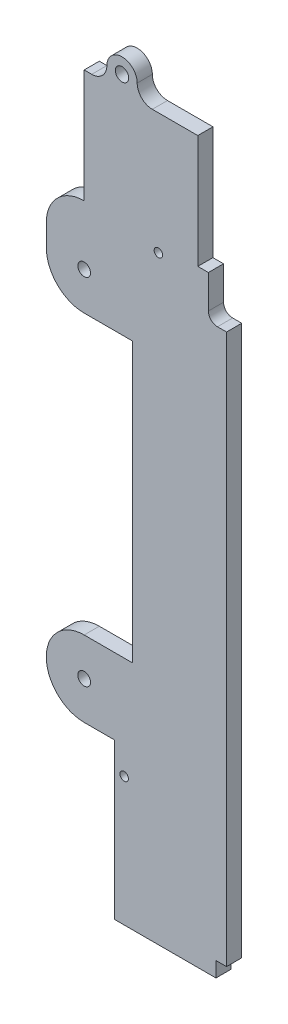
ISO-10303-21;
HEADER;
FILE_DESCRIPTION(('STEP AP214'),'2;1');
FILE_NAME('part.step','',(''),(''),'','','');
FILE_SCHEMA(('AUTOMOTIVE_DESIGN { 1 0 10303 214 1 1 1 1 }'));
ENDSEC;
DATA;
#1=APPLICATION_CONTEXT('core data for automotive mechanical design processes');
#2=APPLICATION_PROTOCOL_DEFINITION('international standard','automotive_design',2000,#1);
#3=PRODUCT_CONTEXT('',#1,'mechanical');
#4=PRODUCT('Part','Part','',(#3));
#5=PRODUCT_RELATED_PRODUCT_CATEGORY('part','',(#4));
#6=PRODUCT_DEFINITION_FORMATION('','',#4);
#7=PRODUCT_DEFINITION_CONTEXT('part definition',#1,'design');
#8=PRODUCT_DEFINITION('design','',#6,#7);
#9=PRODUCT_DEFINITION_SHAPE('','',#8);
#10=(LENGTH_UNIT() NAMED_UNIT(*) SI_UNIT(.MILLI.,.METRE.));
#11=(NAMED_UNIT(*) PLANE_ANGLE_UNIT() SI_UNIT($,.RADIAN.));
#12=(NAMED_UNIT(*) SI_UNIT($,.STERADIAN.) SOLID_ANGLE_UNIT());
#13=UNCERTAINTY_MEASURE_WITH_UNIT(LENGTH_MEASURE(1.E-05),#10,'distance_accuracy_value','');
#14=(GEOMETRIC_REPRESENTATION_CONTEXT(3) GLOBAL_UNCERTAINTY_ASSIGNED_CONTEXT((#13)) GLOBAL_UNIT_ASSIGNED_CONTEXT((#10,
#11,#12)) REPRESENTATION_CONTEXT('',''));
#15=CARTESIAN_POINT('',(0.,0.,0.));
#16=DIRECTION('',(0.,0.,1.));
#17=DIRECTION('',(1.,0.,0.));
#18=AXIS2_PLACEMENT_3D('',#15,#16,#17);
#19=CARTESIAN_POINT('',(44.,125.6,5.));
#20=DIRECTION('',(0.,0.,1.));
#21=DIRECTION('',(1.,0.,0.));
#22=AXIS2_PLACEMENT_3D('',#19,#20,#21);
#23=PLANE('',#22);
#24=CARTESIAN_POINT('',(24.5,134.,5.));
#25=DIRECTION('',(0.,0.,1.));
#26=DIRECTION('',(1.,0.,0.));
#27=AXIS2_PLACEMENT_3D('',#24,#25,#26);
#28=CIRCLE('',#27,1.40000000000001);
#29=CARTESIAN_POINT('',(25.9,134.,5.));
#30=VERTEX_POINT('',#29);
#31=EDGE_CURVE('E455',#30,#30,#28,.T.);
#32=ORIENTED_EDGE('',*,*,#31,.F.);
#33=EDGE_LOOP('',(#32));
#34=FACE_BOUND('',#33,.T.);
#35=CARTESIAN_POINT('',(13.2,-21.3,5.));
#36=DIRECTION('',(0.,0.,1.));
#37=DIRECTION('',(1.,0.,0.));
#38=AXIS2_PLACEMENT_3D('',#35,#36,#37);
#39=CIRCLE('',#38,1.4);
#40=CARTESIAN_POINT('',(14.6,-21.3,5.));
#41=VERTEX_POINT('',#40);
#42=EDGE_CURVE('E457',#41,#41,#39,.T.);
#43=ORIENTED_EDGE('',*,*,#42,.F.);
#44=EDGE_LOOP('',(#43));
#45=FACE_BOUND('',#44,.T.);
#46=CARTESIAN_POINT('',(0.,117.,5.));
#47=DIRECTION('',(0.,0.,1.));
#48=DIRECTION('',(1.,0.,0.));
#49=AXIS2_PLACEMENT_3D('',#46,#47,#48);
#50=CIRCLE('',#49,2.1);
#51=CARTESIAN_POINT('',(2.1,117.,5.));
#52=VERTEX_POINT('',#51);
#53=EDGE_CURVE('E472',#52,#52,#50,.T.);
#54=ORIENTED_EDGE('',*,*,#53,.F.);
#55=EDGE_LOOP('',(#54));
#56=FACE_BOUND('',#55,.T.);
#57=DIRECTION('',(1.,0.,0.));
#58=VECTOR('',#57,1.);
#59=CARTESIAN_POINT('',(43.5,-58.8,5.));
#60=LINE('',#59,#58);
#61=CARTESIAN_POINT('',(43.5,-58.8,5.));
#62=VERTEX_POINT('',#61);
#63=CARTESIAN_POINT('',(47.,-58.8,5.));
#64=VERTEX_POINT('',#63);
#65=EDGE_CURVE('E282',#62,#64,#60,.T.);
#66=ORIENTED_EDGE('',*,*,#65,.T.);
#67=DIRECTION('',(0.,1.,0.));
#68=VECTOR('',#67,1.);
#69=CARTESIAN_POINT('',(47.,-29.8,5.));
#70=LINE('',#69,#68);
#71=CARTESIAN_POINT('',(47.,122.6,5.));
#72=VERTEX_POINT('',#71);
#73=EDGE_CURVE('E149',#64,#72,#70,.T.);
#74=ORIENTED_EDGE('',*,*,#73,.T.);
#75=DIRECTION('',(-1.,0.,0.));
#76=VECTOR('',#75,1.);
#77=CARTESIAN_POINT('',(44.,122.6,5.));
#78=LINE('',#77,#76);
#79=CARTESIAN_POINT('',(44.,122.6,5.));
#80=VERTEX_POINT('',#79);
#81=EDGE_CURVE('E345',#72,#80,#78,.T.);
#82=ORIENTED_EDGE('',*,*,#81,.T.);
#83=CARTESIAN_POINT('',(44.,125.6,5.));
#84=DIRECTION('',(0.,0.,-1.));
#85=DIRECTION('',(1.,0.,0.));
#86=AXIS2_PLACEMENT_3D('',#83,#84,#85);
#87=CIRCLE('',#86,3.);
#88=CARTESIAN_POINT('',(41.,125.6,5.));
#89=VERTEX_POINT('',#88);
#90=EDGE_CURVE('E364',#80,#89,#87,.T.);
#91=ORIENTED_EDGE('',*,*,#90,.T.);
#92=DIRECTION('',(0.,1.,0.));
#93=VECTOR('',#92,1.);
#94=CARTESIAN_POINT('',(41.,136.6,5.));
#95=LINE('',#94,#93);
#96=CARTESIAN_POINT('',(41.,136.6,5.));
#97=VERTEX_POINT('',#96);
#98=EDGE_CURVE('E361',#89,#97,#95,.T.);
#99=ORIENTED_EDGE('',*,*,#98,.T.);
#100=DIRECTION('',(-1.,0.,0.));
#101=VECTOR('',#100,1.);
#102=CARTESIAN_POINT('',(41.,136.6,5.));
#103=LINE('',#102,#101);
#104=CARTESIAN_POINT('',(37.5,136.6,5.));
#105=VERTEX_POINT('',#104);
#106=EDGE_CURVE('E363',#97,#105,#103,.T.);
#107=ORIENTED_EDGE('',*,*,#106,.T.);
#108=DIRECTION('',(0.,1.,0.));
#109=VECTOR('',#108,1.);
#110=CARTESIAN_POINT('',(37.5,136.6,5.));
#111=LINE('',#110,#109);
#112=CARTESIAN_POINT('',(37.5,174.,5.));
#113=VERTEX_POINT('',#112);
#114=EDGE_CURVE('E366',#105,#113,#111,.T.);
#115=ORIENTED_EDGE('',*,*,#114,.T.);
#116=DIRECTION('',(-1.,0.,0.));
#117=VECTOR('',#116,1.);
#118=CARTESIAN_POINT('',(22.5,174.,5.));
#119=LINE('',#118,#117);
#120=CARTESIAN_POINT('',(22.5,174.,5.));
#121=VERTEX_POINT('',#120);
#122=EDGE_CURVE('E372',#113,#121,#119,.T.);
#123=ORIENTED_EDGE('',*,*,#122,.T.);
#124=CARTESIAN_POINT('',(22.5,179.,5.));
#125=DIRECTION('',(0.,0.,-1.));
#126=DIRECTION('',(1.,0.,0.));
#127=AXIS2_PLACEMENT_3D('',#124,#125,#126);
#128=CIRCLE('',#127,4.99999999999998);
#129=CARTESIAN_POINT('',(17.5,179.,5.));
#130=VERTEX_POINT('',#129);
#131=EDGE_CURVE('E374',#121,#130,#128,.T.);
#132=ORIENTED_EDGE('',*,*,#131,.T.);
#133=CARTESIAN_POINT('',(12.5,179.,5.));
#134=DIRECTION('',(0.,0.,1.));
#135=DIRECTION('',(1.,0.,0.));
#136=AXIS2_PLACEMENT_3D('',#133,#134,#135);
#137=CIRCLE('',#136,5.00000000000003);
#138=CARTESIAN_POINT('',(7.49999999999994,179.,5.));
#139=VERTEX_POINT('',#138);
#140=EDGE_CURVE('E376',#130,#139,#137,.T.);
#141=ORIENTED_EDGE('',*,*,#140,.T.);
#142=CARTESIAN_POINT('',(2.49999999999997,179.,5.));
#143=DIRECTION('',(0.,0.,-1.));
#144=DIRECTION('',(1.,0.,0.));
#145=AXIS2_PLACEMENT_3D('',#142,#143,#144);
#146=CIRCLE('',#145,4.99999999999999);
#147=CARTESIAN_POINT('',(2.49999999999997,174.,5.));
#148=VERTEX_POINT('',#147);
#149=EDGE_CURVE('E378',#139,#148,#146,.T.);
#150=ORIENTED_EDGE('',*,*,#149,.T.);
#151=DIRECTION('',(-1.,0.,0.));
#152=VECTOR('',#151,1.);
#153=CARTESIAN_POINT('',(0.,174.,5.));
#154=LINE('',#153,#152);
#155=CARTESIAN_POINT('',(0.,174.,5.));
#156=VERTEX_POINT('',#155);
#157=EDGE_CURVE('E380',#148,#156,#154,.T.);
#158=ORIENTED_EDGE('',*,*,#157,.T.);
#159=DIRECTION('',(0.,-1.,0.));
#160=VECTOR('',#159,1.);
#161=CARTESIAN_POINT('',(0.,136.6,5.));
#162=LINE('',#161,#160);
#163=CARTESIAN_POINT('',(0.,136.6,5.));
#164=VERTEX_POINT('',#163);
#165=EDGE_CURVE('E382',#156,#164,#162,.T.);
#166=ORIENTED_EDGE('',*,*,#165,.T.);
#167=CARTESIAN_POINT('',(0.,124.1,5.));
#168=DIRECTION('',(0.,0.,1.));
#169=DIRECTION('',(1.,0.,0.));
#170=AXIS2_PLACEMENT_3D('',#167,#168,#169);
#171=CIRCLE('',#170,12.5);
#172=CARTESIAN_POINT('',(-12.5,124.1,5.));
#173=VERTEX_POINT('',#172);
#174=EDGE_CURVE('E384',#164,#173,#171,.T.);
#175=ORIENTED_EDGE('',*,*,#174,.T.);
#176=DIRECTION('',(0.,-1.,0.));
#177=VECTOR('',#176,1.);
#178=CARTESIAN_POINT('',(-12.5,124.1,5.));
#179=LINE('',#178,#177);
#180=CARTESIAN_POINT('',(-12.5,117.,5.));
#181=VERTEX_POINT('',#180);
#182=EDGE_CURVE('E386',#173,#181,#179,.T.);
#183=ORIENTED_EDGE('',*,*,#182,.T.);
#184=CARTESIAN_POINT('',(0.,117.,5.));
#185=DIRECTION('',(0.,0.,1.));
#186=DIRECTION('',(1.,0.,0.));
#187=AXIS2_PLACEMENT_3D('',#184,#185,#186);
#188=CIRCLE('',#187,12.5);
#189=CARTESIAN_POINT('',(0.,104.5,5.));
#190=VERTEX_POINT('',#189);
#191=EDGE_CURVE('E388',#181,#190,#188,.T.);
#192=ORIENTED_EDGE('',*,*,#191,.T.);
#193=DIRECTION('',(1.,0.,0.));
#194=VECTOR('',#193,1.);
#195=CARTESIAN_POINT('',(16.,104.5,5.));
#196=LINE('',#195,#194);
#197=CARTESIAN_POINT('',(16.,104.5,5.));
#198=VERTEX_POINT('',#197);
#199=EDGE_CURVE('E390',#190,#198,#196,.T.);
#200=ORIENTED_EDGE('',*,*,#199,.T.);
#201=DIRECTION('',(0.,-1.,0.));
#202=VECTOR('',#201,1.);
#203=CARTESIAN_POINT('',(16.,12.5,5.));
#204=LINE('',#203,#202);
#205=CARTESIAN_POINT('',(16.,12.5,5.));
#206=VERTEX_POINT('',#205);
#207=EDGE_CURVE('E392',#198,#206,#204,.T.);
#208=ORIENTED_EDGE('',*,*,#207,.T.);
#209=DIRECTION('',(-1.,0.,0.));
#210=VECTOR('',#209,1.);
#211=CARTESIAN_POINT('',(0.,12.5,5.));
#212=LINE('',#211,#210);
#213=CARTESIAN_POINT('',(0.,12.5,5.));
#214=VERTEX_POINT('',#213);
#215=EDGE_CURVE('E394',#206,#214,#212,.T.);
#216=ORIENTED_EDGE('',*,*,#215,.T.);
#217=CARTESIAN_POINT('',(0.,0.,5.));
#218=DIRECTION('',(0.,0.,1.));
#219=DIRECTION('',(1.,0.,0.));
#220=AXIS2_PLACEMENT_3D('',#217,#218,#219);
#221=CIRCLE('',#220,12.5);
#222=CARTESIAN_POINT('',(0.,-12.5,5.));
#223=VERTEX_POINT('',#222);
#224=EDGE_CURVE('E396',#214,#223,#221,.T.);
#225=ORIENTED_EDGE('',*,*,#224,.T.);
#226=DIRECTION('',(1.,0.,0.));
#227=VECTOR('',#226,1.);
#228=CARTESIAN_POINT('',(0.,-12.5,5.));
#229=LINE('',#228,#227);
#230=CARTESIAN_POINT('',(10.,-12.5,5.));
#231=VERTEX_POINT('',#230);
#232=EDGE_CURVE('E216',#223,#231,#229,.T.);
#233=ORIENTED_EDGE('',*,*,#232,.T.);
#234=DIRECTION('',(0.,-1.,0.));
#235=VECTOR('',#234,1.);
#236=CARTESIAN_POINT('',(10.,-12.5,5.));
#237=LINE('',#236,#235);
#238=CARTESIAN_POINT('',(10.,-63.8,5.));
#239=VERTEX_POINT('',#238);
#240=EDGE_CURVE('E210',#231,#239,#237,.T.);
#241=ORIENTED_EDGE('',*,*,#240,.T.);
#242=DIRECTION('',(1.,0.,0.));
#243=VECTOR('',#242,1.);
#244=CARTESIAN_POINT('',(43.5,-63.8,5.));
#245=LINE('',#244,#243);
#246=CARTESIAN_POINT('',(43.5,-63.8,5.));
#247=VERTEX_POINT('',#246);
#248=EDGE_CURVE('E214',#239,#247,#245,.T.);
#249=ORIENTED_EDGE('',*,*,#248,.T.);
#250=DIRECTION('',(0.,1.,0.));
#251=VECTOR('',#250,1.);
#252=CARTESIAN_POINT('',(43.5,-58.8,5.));
#253=LINE('',#252,#251);
#254=EDGE_CURVE('E58',#247,#62,#253,.T.);
#255=ORIENTED_EDGE('',*,*,#254,.T.);
#256=EDGE_LOOP('',(#66,#74,#82,#91,#99,#107,#115,#123,#132,#141,#150,#158,#166,#175,#183,#192,
#200,#208,#216,#225,#233,#241,#249,#255));
#257=FACE_BOUND('',#256,.T.);
#258=CARTESIAN_POINT('',(0.,0.,5.));
#259=DIRECTION('',(0.,0.,1.));
#260=DIRECTION('',(1.,0.,0.));
#261=AXIS2_PLACEMENT_3D('',#258,#259,#260);
#262=CIRCLE('',#261,2.1);
#263=CARTESIAN_POINT('',(2.1,0.,5.));
#264=VERTEX_POINT('',#263);
#265=EDGE_CURVE('E237',#264,#264,#262,.T.);
#266=ORIENTED_EDGE('',*,*,#265,.F.);
#267=EDGE_LOOP('',(#266));
#268=FACE_BOUND('',#267,.T.);
#269=CARTESIAN_POINT('',(12.5,179.,5.));
#270=DIRECTION('',(0.,0.,1.));
#271=DIRECTION('',(1.,0.,0.));
#272=AXIS2_PLACEMENT_3D('',#269,#270,#271);
#273=CIRCLE('',#272,2.2);
#274=CARTESIAN_POINT('',(14.7,179.,5.));
#275=VERTEX_POINT('',#274);
#276=EDGE_CURVE('E466',#275,#275,#273,.T.);
#277=ORIENTED_EDGE('',*,*,#276,.F.);
#278=EDGE_LOOP('',(#277));
#279=FACE_BOUND('',#278,.T.);
#280=ADVANCED_FACE('F41',(#34,#45,#56,#257,#268,#279),#23,.T.);
#281=CARTESIAN_POINT('',(44.,125.6,0.));
#282=DIRECTION('',(0.,0.,1.));
#283=DIRECTION('',(1.,0.,0.));
#284=AXIS2_PLACEMENT_3D('',#281,#282,#283);
#285=PLANE('',#284);
#286=CARTESIAN_POINT('',(24.5,134.,0.));
#287=DIRECTION('',(0.,0.,1.));
#288=DIRECTION('',(1.,0.,0.));
#289=AXIS2_PLACEMENT_3D('',#286,#287,#288);
#290=CIRCLE('',#289,1.40000000000001);
#291=CARTESIAN_POINT('',(25.9,134.,0.));
#292=VERTEX_POINT('',#291);
#293=EDGE_CURVE('E453',#292,#292,#290,.T.);
#294=ORIENTED_EDGE('',*,*,#293,.T.);
#295=EDGE_LOOP('',(#294));
#296=FACE_BOUND('',#295,.T.);
#297=CARTESIAN_POINT('',(13.2,-21.3,0.));
#298=DIRECTION('',(0.,0.,1.));
#299=DIRECTION('',(1.,0.,0.));
#300=AXIS2_PLACEMENT_3D('',#297,#298,#299);
#301=CIRCLE('',#300,1.4);
#302=CARTESIAN_POINT('',(14.6,-21.3,0.));
#303=VERTEX_POINT('',#302);
#304=EDGE_CURVE('E460',#303,#303,#301,.T.);
#305=ORIENTED_EDGE('',*,*,#304,.T.);
#306=EDGE_LOOP('',(#305));
#307=FACE_BOUND('',#306,.T.);
#308=CARTESIAN_POINT('',(0.,117.,0.));
#309=DIRECTION('',(0.,0.,1.));
#310=DIRECTION('',(1.,0.,0.));
#311=AXIS2_PLACEMENT_3D('',#308,#309,#310);
#312=CIRCLE('',#311,2.1);
#313=CARTESIAN_POINT('',(2.1,117.,0.));
#314=VERTEX_POINT('',#313);
#315=EDGE_CURVE('E469',#314,#314,#312,.T.);
#316=ORIENTED_EDGE('',*,*,#315,.T.);
#317=EDGE_LOOP('',(#316));
#318=FACE_BOUND('',#317,.T.);
#319=DIRECTION('',(1.,0.,0.));
#320=VECTOR('',#319,1.);
#321=CARTESIAN_POINT('',(43.5,-58.8,0.));
#322=LINE('',#321,#320);
#323=CARTESIAN_POINT('',(43.5,-58.8,0.));
#324=VERTEX_POINT('',#323);
#325=CARTESIAN_POINT('',(47.,-58.8,0.));
#326=VERTEX_POINT('',#325);
#327=EDGE_CURVE('E233',#324,#326,#322,.T.);
#328=ORIENTED_EDGE('',*,*,#327,.F.);
#329=DIRECTION('',(0.,1.,0.));
#330=VECTOR('',#329,1.);
#331=CARTESIAN_POINT('',(43.5,-58.8,0.));
#332=LINE('',#331,#330);
#333=CARTESIAN_POINT('',(43.5,-63.8,0.));
#334=VERTEX_POINT('',#333);
#335=EDGE_CURVE('E141',#334,#324,#332,.T.);
#336=ORIENTED_EDGE('',*,*,#335,.F.);
#337=DIRECTION('',(1.,0.,0.));
#338=VECTOR('',#337,1.);
#339=CARTESIAN_POINT('',(43.5,-63.8,0.));
#340=LINE('',#339,#338);
#341=CARTESIAN_POINT('',(10.,-63.8,0.));
#342=VERTEX_POINT('',#341);
#343=EDGE_CURVE('E135',#342,#334,#340,.T.);
#344=ORIENTED_EDGE('',*,*,#343,.F.);
#345=DIRECTION('',(0.,-1.,0.));
#346=VECTOR('',#345,1.);
#347=CARTESIAN_POINT('',(10.,-63.8,0.));
#348=LINE('',#347,#346);
#349=CARTESIAN_POINT('',(10.,-12.5,0.));
#350=VERTEX_POINT('',#349);
#351=EDGE_CURVE('E223',#350,#342,#348,.T.);
#352=ORIENTED_EDGE('',*,*,#351,.F.);
#353=DIRECTION('',(1.,0.,0.));
#354=VECTOR('',#353,1.);
#355=CARTESIAN_POINT('',(0.,-12.5,0.));
#356=LINE('',#355,#354);
#357=CARTESIAN_POINT('',(0.,-12.5,0.));
#358=VERTEX_POINT('',#357);
#359=EDGE_CURVE('E276',#358,#350,#356,.T.);
#360=ORIENTED_EDGE('',*,*,#359,.F.);
#361=CARTESIAN_POINT('',(0.,0.,0.));
#362=DIRECTION('',(0.,0.,1.));
#363=DIRECTION('',(1.,0.,0.));
#364=AXIS2_PLACEMENT_3D('',#361,#362,#363);
#365=CIRCLE('',#364,12.5);
#366=CARTESIAN_POINT('',(0.,12.5,0.));
#367=VERTEX_POINT('',#366);
#368=EDGE_CURVE('E274',#367,#358,#365,.T.);
#369=ORIENTED_EDGE('',*,*,#368,.F.);
#370=DIRECTION('',(-1.,0.,0.));
#371=VECTOR('',#370,1.);
#372=CARTESIAN_POINT('',(0.,12.5,0.));
#373=LINE('',#372,#371);
#374=CARTESIAN_POINT('',(16.,12.5,0.));
#375=VERTEX_POINT('',#374);
#376=EDGE_CURVE('E272',#375,#367,#373,.T.);
#377=ORIENTED_EDGE('',*,*,#376,.F.);
#378=DIRECTION('',(0.,-1.,0.));
#379=VECTOR('',#378,1.);
#380=CARTESIAN_POINT('',(16.,12.5,0.));
#381=LINE('',#380,#379);
#382=CARTESIAN_POINT('',(16.,104.5,0.));
#383=VERTEX_POINT('',#382);
#384=EDGE_CURVE('E270',#383,#375,#381,.T.);
#385=ORIENTED_EDGE('',*,*,#384,.F.);
#386=DIRECTION('',(1.,0.,0.));
#387=VECTOR('',#386,1.);
#388=CARTESIAN_POINT('',(16.,104.5,0.));
#389=LINE('',#388,#387);
#390=CARTESIAN_POINT('',(0.,104.5,0.));
#391=VERTEX_POINT('',#390);
#392=EDGE_CURVE('E268',#391,#383,#389,.T.);
#393=ORIENTED_EDGE('',*,*,#392,.F.);
#394=CARTESIAN_POINT('',(0.,117.,0.));
#395=DIRECTION('',(0.,0.,1.));
#396=DIRECTION('',(1.,0.,0.));
#397=AXIS2_PLACEMENT_3D('',#394,#395,#396);
#398=CIRCLE('',#397,12.5);
#399=CARTESIAN_POINT('',(-12.5,117.,0.));
#400=VERTEX_POINT('',#399);
#401=EDGE_CURVE('E266',#400,#391,#398,.T.);
#402=ORIENTED_EDGE('',*,*,#401,.F.);
#403=DIRECTION('',(0.,-1.,0.));
#404=VECTOR('',#403,1.);
#405=CARTESIAN_POINT('',(-12.5,124.1,0.));
#406=LINE('',#405,#404);
#407=CARTESIAN_POINT('',(-12.5,124.1,0.));
#408=VERTEX_POINT('',#407);
#409=EDGE_CURVE('E264',#408,#400,#406,.T.);
#410=ORIENTED_EDGE('',*,*,#409,.F.);
#411=CARTESIAN_POINT('',(0.,124.1,0.));
#412=DIRECTION('',(0.,0.,1.));
#413=DIRECTION('',(1.,0.,0.));
#414=AXIS2_PLACEMENT_3D('',#411,#412,#413);
#415=CIRCLE('',#414,12.5);
#416=CARTESIAN_POINT('',(0.,136.6,0.));
#417=VERTEX_POINT('',#416);
#418=EDGE_CURVE('E262',#417,#408,#415,.T.);
#419=ORIENTED_EDGE('',*,*,#418,.F.);
#420=DIRECTION('',(0.,-1.,0.));
#421=VECTOR('',#420,1.);
#422=CARTESIAN_POINT('',(0.,136.6,0.));
#423=LINE('',#422,#421);
#424=CARTESIAN_POINT('',(0.,174.,0.));
#425=VERTEX_POINT('',#424);
#426=EDGE_CURVE('E260',#425,#417,#423,.T.);
#427=ORIENTED_EDGE('',*,*,#426,.F.);
#428=DIRECTION('',(-1.,0.,0.));
#429=VECTOR('',#428,1.);
#430=CARTESIAN_POINT('',(0.,174.,0.));
#431=LINE('',#430,#429);
#432=CARTESIAN_POINT('',(2.49999999999997,174.,0.));
#433=VERTEX_POINT('',#432);
#434=EDGE_CURVE('E258',#433,#425,#431,.T.);
#435=ORIENTED_EDGE('',*,*,#434,.F.);
#436=CARTESIAN_POINT('',(2.49999999999997,179.,0.));
#437=DIRECTION('',(0.,0.,-1.));
#438=DIRECTION('',(1.,0.,0.));
#439=AXIS2_PLACEMENT_3D('',#436,#437,#438);
#440=CIRCLE('',#439,4.99999999999999);
#441=CARTESIAN_POINT('',(7.49999999999994,179.,0.));
#442=VERTEX_POINT('',#441);
#443=EDGE_CURVE('E256',#442,#433,#440,.T.);
#444=ORIENTED_EDGE('',*,*,#443,.F.);
#445=CARTESIAN_POINT('',(12.5,179.,0.));
#446=DIRECTION('',(0.,0.,1.));
#447=DIRECTION('',(1.,0.,0.));
#448=AXIS2_PLACEMENT_3D('',#445,#446,#447);
#449=CIRCLE('',#448,5.00000000000003);
#450=CARTESIAN_POINT('',(17.5,179.,0.));
#451=VERTEX_POINT('',#450);
#452=EDGE_CURVE('E254',#451,#442,#449,.T.);
#453=ORIENTED_EDGE('',*,*,#452,.F.);
#454=CARTESIAN_POINT('',(22.5,179.,0.));
#455=DIRECTION('',(0.,0.,-1.));
#456=DIRECTION('',(1.,0.,0.));
#457=AXIS2_PLACEMENT_3D('',#454,#455,#456);
#458=CIRCLE('',#457,4.99999999999998);
#459=CARTESIAN_POINT('',(22.5,174.,0.));
#460=VERTEX_POINT('',#459);
#461=EDGE_CURVE('E252',#460,#451,#458,.T.);
#462=ORIENTED_EDGE('',*,*,#461,.F.);
#463=DIRECTION('',(-1.,0.,0.));
#464=VECTOR('',#463,1.);
#465=CARTESIAN_POINT('',(22.5,174.,0.));
#466=LINE('',#465,#464);
#467=CARTESIAN_POINT('',(37.5,174.,0.));
#468=VERTEX_POINT('',#467);
#469=EDGE_CURVE('E250',#468,#460,#466,.T.);
#470=ORIENTED_EDGE('',*,*,#469,.F.);
#471=DIRECTION('',(0.,1.,0.));
#472=VECTOR('',#471,1.);
#473=CARTESIAN_POINT('',(37.5,136.6,0.));
#474=LINE('',#473,#472);
#475=CARTESIAN_POINT('',(37.5,136.6,0.));
#476=VERTEX_POINT('',#475);
#477=EDGE_CURVE('E248',#476,#468,#474,.T.);
#478=ORIENTED_EDGE('',*,*,#477,.F.);
#479=DIRECTION('',(-1.,0.,0.));
#480=VECTOR('',#479,1.);
#481=CARTESIAN_POINT('',(41.,136.6,0.));
#482=LINE('',#481,#480);
#483=CARTESIAN_POINT('',(41.,136.6,0.));
#484=VERTEX_POINT('',#483);
#485=EDGE_CURVE('E246',#484,#476,#482,.T.);
#486=ORIENTED_EDGE('',*,*,#485,.F.);
#487=DIRECTION('',(0.,1.,0.));
#488=VECTOR('',#487,1.);
#489=CARTESIAN_POINT('',(41.,136.6,0.));
#490=LINE('',#489,#488);
#491=CARTESIAN_POINT('',(41.,125.6,0.));
#492=VERTEX_POINT('',#491);
#493=EDGE_CURVE('E244',#492,#484,#490,.T.);
#494=ORIENTED_EDGE('',*,*,#493,.F.);
#495=CARTESIAN_POINT('',(44.,125.6,0.));
#496=DIRECTION('',(0.,0.,-1.));
#497=DIRECTION('',(1.,0.,0.));
#498=AXIS2_PLACEMENT_3D('',#495,#496,#497);
#499=CIRCLE('',#498,3.);
#500=CARTESIAN_POINT('',(44.,122.6,0.));
#501=VERTEX_POINT('',#500);
#502=EDGE_CURVE('E242',#501,#492,#499,.T.);
#503=ORIENTED_EDGE('',*,*,#502,.F.);
#504=DIRECTION('',(-1.,0.,0.));
#505=VECTOR('',#504,1.);
#506=CARTESIAN_POINT('',(44.,122.6,0.));
#507=LINE('',#506,#505);
#508=CARTESIAN_POINT('',(47.,122.6,0.));
#509=VERTEX_POINT('',#508);
#510=EDGE_CURVE('E240',#509,#501,#507,.T.);
#511=ORIENTED_EDGE('',*,*,#510,.F.);
#512=DIRECTION('',(0.,1.,0.));
#513=VECTOR('',#512,1.);
#514=CARTESIAN_POINT('',(47.,122.6,0.));
#515=LINE('',#514,#513);
#516=EDGE_CURVE('E236',#326,#509,#515,.T.);
#517=ORIENTED_EDGE('',*,*,#516,.F.);
#518=EDGE_LOOP('',(#328,#336,#344,#352,#360,#369,#377,#385,#393,#402,#410,#419,#427,#435,#444,
#453,#462,#470,#478,#486,#494,#503,#511,#517));
#519=FACE_BOUND('',#518,.T.);
#520=CARTESIAN_POINT('',(0.,0.,0.));
#521=DIRECTION('',(0.,0.,1.));
#522=DIRECTION('',(1.,0.,0.));
#523=AXIS2_PLACEMENT_3D('',#520,#521,#522);
#524=CIRCLE('',#523,2.1);
#525=CARTESIAN_POINT('',(2.1,0.,0.));
#526=VERTEX_POINT('',#525);
#527=EDGE_CURVE('E475',#526,#526,#524,.T.);
#528=ORIENTED_EDGE('',*,*,#527,.T.);
#529=EDGE_LOOP('',(#528));
#530=FACE_BOUND('',#529,.T.);
#531=CARTESIAN_POINT('',(12.5,179.,0.));
#532=DIRECTION('',(0.,0.,1.));
#533=DIRECTION('',(1.,0.,0.));
#534=AXIS2_PLACEMENT_3D('',#531,#532,#533);
#535=CIRCLE('',#534,2.2);
#536=CARTESIAN_POINT('',(14.7,179.,0.));
#537=VERTEX_POINT('',#536);
#538=EDGE_CURVE('E463',#537,#537,#535,.T.);
#539=ORIENTED_EDGE('',*,*,#538,.T.);
#540=EDGE_LOOP('',(#539));
#541=FACE_BOUND('',#540,.T.);
#542=ADVANCED_FACE('F349',(#296,#307,#318,#519,#530,#541),#285,.F.);
#543=CARTESIAN_POINT('',(43.5,-58.8,5.));
#544=DIRECTION('',(0.,1.,0.));
#545=DIRECTION('',(0.,0.,1.));
#546=AXIS2_PLACEMENT_3D('',#543,#544,#545);
#547=PLANE('',#546);
#548=ORIENTED_EDGE('',*,*,#327,.T.);
#549=DIRECTION('',(0.,0.,-1.));
#550=VECTOR('',#549,1.);
#551=CARTESIAN_POINT('',(47.,-58.8,5.));
#552=LINE('',#551,#550);
#553=EDGE_CURVE('E11',#64,#326,#552,.T.);
#554=ORIENTED_EDGE('',*,*,#553,.F.);
#555=ORIENTED_EDGE('',*,*,#65,.F.);
#556=DIRECTION('',(0.,0.,-1.));
#557=VECTOR('',#556,1.);
#558=CARTESIAN_POINT('',(43.5,-58.8,5.));
#559=LINE('',#558,#557);
#560=EDGE_CURVE('E229',#62,#324,#559,.T.);
#561=ORIENTED_EDGE('',*,*,#560,.T.);
#562=EDGE_LOOP('',(#548,#554,#555,#561));
#563=FACE_BOUND('',#562,.T.);
#564=ADVANCED_FACE('F43',(#563),#547,.F.);
#565=CARTESIAN_POINT('',(47.,122.6,5.));
#566=DIRECTION('',(-1.,0.,0.));
#567=DIRECTION('',(0.,-1.,0.));
#568=AXIS2_PLACEMENT_3D('',#565,#566,#567);
#569=PLANE('',#568);
#570=ORIENTED_EDGE('',*,*,#516,.T.);
#571=DIRECTION('',(0.,0.,-1.));
#572=VECTOR('',#571,1.);
#573=CARTESIAN_POINT('',(47.,122.6,5.));
#574=LINE('',#573,#572);
#575=EDGE_CURVE('E50',#72,#509,#574,.T.);
#576=ORIENTED_EDGE('',*,*,#575,.F.);
#577=ORIENTED_EDGE('',*,*,#73,.F.);
#578=ORIENTED_EDGE('',*,*,#553,.T.);
#579=EDGE_LOOP('',(#570,#576,#577,#578));
#580=FACE_BOUND('',#579,.T.);
#581=ADVANCED_FACE('F719',(#580),#569,.F.);
#582=CARTESIAN_POINT('',(44.,122.6,5.));
#583=DIRECTION('',(0.,-1.,0.));
#584=DIRECTION('',(1.,0.,0.));
#585=AXIS2_PLACEMENT_3D('',#582,#583,#584);
#586=PLANE('',#585);
#587=ORIENTED_EDGE('',*,*,#510,.T.);
#588=DIRECTION('',(0.,0.,-1.));
#589=VECTOR('',#588,1.);
#590=CARTESIAN_POINT('',(44.,122.6,5.));
#591=LINE('',#590,#589);
#592=EDGE_CURVE('E337',#80,#501,#591,.T.);
#593=ORIENTED_EDGE('',*,*,#592,.F.);
#594=ORIENTED_EDGE('',*,*,#81,.F.);
#595=ORIENTED_EDGE('',*,*,#575,.T.);
#596=EDGE_LOOP('',(#587,#593,#594,#595));
#597=FACE_BOUND('',#596,.T.);
#598=ADVANCED_FACE('F343',(#597),#586,.F.);
#599=CARTESIAN_POINT('',(44.,125.6,5.));
#600=DIRECTION('',(0.,0.,-1.));
#601=DIRECTION('',(-1.,0.,0.));
#602=AXIS2_PLACEMENT_3D('',#599,#600,#601);
#603=CYLINDRICAL_SURFACE('',#602,3.);
#604=ORIENTED_EDGE('',*,*,#502,.T.);
#605=DIRECTION('',(0.,0.,-1.));
#606=VECTOR('',#605,1.);
#607=CARTESIAN_POINT('',(41.,125.6,5.));
#608=LINE('',#607,#606);
#609=EDGE_CURVE('E334',#89,#492,#608,.T.);
#610=ORIENTED_EDGE('',*,*,#609,.F.);
#611=ORIENTED_EDGE('',*,*,#90,.F.);
#612=ORIENTED_EDGE('',*,*,#592,.T.);
#613=EDGE_LOOP('',(#604,#610,#611,#612));
#614=FACE_BOUND('',#613,.T.);
#615=ADVANCED_FACE('F355',(#614),#603,.F.);
#616=CARTESIAN_POINT('',(41.,136.6,5.));
#617=DIRECTION('',(-1.,0.,0.));
#618=DIRECTION('',(0.,0.,1.));
#619=AXIS2_PLACEMENT_3D('',#616,#617,#618);
#620=PLANE('',#619);
#621=ORIENTED_EDGE('',*,*,#493,.T.);
#622=DIRECTION('',(0.,0.,-1.));
#623=VECTOR('',#622,1.);
#624=CARTESIAN_POINT('',(41.,136.6,5.));
#625=LINE('',#624,#623);
#626=EDGE_CURVE('E331',#97,#484,#625,.T.);
#627=ORIENTED_EDGE('',*,*,#626,.F.);
#628=ORIENTED_EDGE('',*,*,#98,.F.);
#629=ORIENTED_EDGE('',*,*,#609,.T.);
#630=EDGE_LOOP('',(#621,#627,#628,#629));
#631=FACE_BOUND('',#630,.T.);
#632=ADVANCED_FACE('F359',(#631),#620,.F.);
#633=CARTESIAN_POINT('',(41.,136.6,5.));
#634=DIRECTION('',(0.,-1.,0.));
#635=DIRECTION('',(1.,0.,0.));
#636=AXIS2_PLACEMENT_3D('',#633,#634,#635);
#637=PLANE('',#636);
#638=ORIENTED_EDGE('',*,*,#485,.T.);
#639=DIRECTION('',(0.,0.,-1.));
#640=VECTOR('',#639,1.);
#641=CARTESIAN_POINT('',(37.5,136.6,5.));
#642=LINE('',#641,#640);
#643=EDGE_CURVE('E328',#105,#476,#642,.T.);
#644=ORIENTED_EDGE('',*,*,#643,.F.);
#645=ORIENTED_EDGE('',*,*,#106,.F.);
#646=ORIENTED_EDGE('',*,*,#626,.T.);
#647=EDGE_LOOP('',(#638,#644,#645,#646));
#648=FACE_BOUND('',#647,.T.);
#649=ADVANCED_FACE('F684',(#648),#637,.F.);
#650=CARTESIAN_POINT('',(37.5,136.6,5.));
#651=DIRECTION('',(-1.,0.,0.));
#652=DIRECTION('',(0.,0.,1.));
#653=AXIS2_PLACEMENT_3D('',#650,#651,#652);
#654=PLANE('',#653);
#655=ORIENTED_EDGE('',*,*,#477,.T.);
#656=DIRECTION('',(0.,0.,-1.));
#657=VECTOR('',#656,1.);
#658=CARTESIAN_POINT('',(37.5,174.,5.));
#659=LINE('',#658,#657);
#660=EDGE_CURVE('E325',#113,#468,#659,.T.);
#661=ORIENTED_EDGE('',*,*,#660,.F.);
#662=ORIENTED_EDGE('',*,*,#114,.F.);
#663=ORIENTED_EDGE('',*,*,#643,.T.);
#664=EDGE_LOOP('',(#655,#661,#662,#663));
#665=FACE_BOUND('',#664,.T.);
#666=ADVANCED_FACE('F674',(#665),#654,.F.);
#667=CARTESIAN_POINT('',(22.5,174.,5.));
#668=DIRECTION('',(0.,-1.,0.));
#669=DIRECTION('',(0.,0.,-1.));
#670=AXIS2_PLACEMENT_3D('',#667,#668,#669);
#671=PLANE('',#670);
#672=ORIENTED_EDGE('',*,*,#469,.T.);
#673=DIRECTION('',(0.,0.,-1.));
#674=VECTOR('',#673,1.);
#675=CARTESIAN_POINT('',(22.5,174.,5.));
#676=LINE('',#675,#674);
#677=EDGE_CURVE('E322',#121,#460,#676,.T.);
#678=ORIENTED_EDGE('',*,*,#677,.F.);
#679=ORIENTED_EDGE('',*,*,#122,.F.);
#680=ORIENTED_EDGE('',*,*,#660,.T.);
#681=EDGE_LOOP('',(#672,#678,#679,#680));
#682=FACE_BOUND('',#681,.T.);
#683=ADVANCED_FACE('F664',(#682),#671,.F.);
#684=CARTESIAN_POINT('',(22.5,179.,5.));
#685=DIRECTION('',(0.,0.,-1.));
#686=DIRECTION('',(-1.,0.,0.));
#687=AXIS2_PLACEMENT_3D('',#684,#685,#686);
#688=CYLINDRICAL_SURFACE('',#687,4.99999999999998);
#689=ORIENTED_EDGE('',*,*,#461,.T.);
#690=DIRECTION('',(0.,0.,-1.));
#691=VECTOR('',#690,1.);
#692=CARTESIAN_POINT('',(17.5,179.,5.));
#693=LINE('',#692,#691);
#694=EDGE_CURVE('E319',#130,#451,#693,.T.);
#695=ORIENTED_EDGE('',*,*,#694,.F.);
#696=ORIENTED_EDGE('',*,*,#131,.F.);
#697=ORIENTED_EDGE('',*,*,#677,.T.);
#698=EDGE_LOOP('',(#689,#695,#696,#697));
#699=FACE_BOUND('',#698,.T.);
#700=ADVANCED_FACE('F654',(#699),#688,.F.);
#701=CARTESIAN_POINT('',(12.5,179.,5.));
#702=DIRECTION('',(0.,0.,-1.));
#703=DIRECTION('',(-1.,0.,0.));
#704=AXIS2_PLACEMENT_3D('',#701,#702,#703);
#705=CYLINDRICAL_SURFACE('',#704,5.00000000000003);
#706=ORIENTED_EDGE('',*,*,#452,.T.);
#707=DIRECTION('',(0.,0.,-1.));
#708=VECTOR('',#707,1.);
#709=CARTESIAN_POINT('',(7.49999999999994,179.,5.));
#710=LINE('',#709,#708);
#711=EDGE_CURVE('E316',#139,#442,#710,.T.);
#712=ORIENTED_EDGE('',*,*,#711,.F.);
#713=ORIENTED_EDGE('',*,*,#140,.F.);
#714=ORIENTED_EDGE('',*,*,#694,.T.);
#715=EDGE_LOOP('',(#706,#712,#713,#714));
#716=FACE_BOUND('',#715,.T.);
#717=ADVANCED_FACE('F644',(#716),#705,.T.);
#718=CARTESIAN_POINT('',(2.49999999999997,179.,5.));
#719=DIRECTION('',(0.,0.,-1.));
#720=DIRECTION('',(-1.,0.,0.));
#721=AXIS2_PLACEMENT_3D('',#718,#719,#720);
#722=CYLINDRICAL_SURFACE('',#721,4.99999999999999);
#723=ORIENTED_EDGE('',*,*,#443,.T.);
#724=DIRECTION('',(0.,0.,-1.));
#725=VECTOR('',#724,1.);
#726=CARTESIAN_POINT('',(2.49999999999997,174.,5.));
#727=LINE('',#726,#725);
#728=EDGE_CURVE('E313',#148,#433,#727,.T.);
#729=ORIENTED_EDGE('',*,*,#728,.F.);
#730=ORIENTED_EDGE('',*,*,#149,.F.);
#731=ORIENTED_EDGE('',*,*,#711,.T.);
#732=EDGE_LOOP('',(#723,#729,#730,#731));
#733=FACE_BOUND('',#732,.T.);
#734=ADVANCED_FACE('F634',(#733),#722,.F.);
#735=CARTESIAN_POINT('',(0.,174.,5.));
#736=DIRECTION('',(0.,-1.,0.));
#737=DIRECTION('',(0.,0.,-1.));
#738=AXIS2_PLACEMENT_3D('',#735,#736,#737);
#739=PLANE('',#738);
#740=ORIENTED_EDGE('',*,*,#434,.T.);
#741=DIRECTION('',(0.,0.,-1.));
#742=VECTOR('',#741,1.);
#743=CARTESIAN_POINT('',(0.,174.,5.));
#744=LINE('',#743,#742);
#745=EDGE_CURVE('E310',#156,#425,#744,.T.);
#746=ORIENTED_EDGE('',*,*,#745,.F.);
#747=ORIENTED_EDGE('',*,*,#157,.F.);
#748=ORIENTED_EDGE('',*,*,#728,.T.);
#749=EDGE_LOOP('',(#740,#746,#747,#748));
#750=FACE_BOUND('',#749,.T.);
#751=ADVANCED_FACE('F624',(#750),#739,.F.);
#752=CARTESIAN_POINT('',(0.,136.6,5.));
#753=DIRECTION('',(1.,0.,0.));
#754=DIRECTION('',(0.,0.,-1.));
#755=AXIS2_PLACEMENT_3D('',#752,#753,#754);
#756=PLANE('',#755);
#757=ORIENTED_EDGE('',*,*,#426,.T.);
#758=DIRECTION('',(0.,0.,-1.));
#759=VECTOR('',#758,1.);
#760=CARTESIAN_POINT('',(0.,136.6,5.));
#761=LINE('',#760,#759);
#762=EDGE_CURVE('E307',#164,#417,#761,.T.);
#763=ORIENTED_EDGE('',*,*,#762,.F.);
#764=ORIENTED_EDGE('',*,*,#165,.F.);
#765=ORIENTED_EDGE('',*,*,#745,.T.);
#766=EDGE_LOOP('',(#757,#763,#764,#765));
#767=FACE_BOUND('',#766,.T.);
#768=ADVANCED_FACE('F614',(#767),#756,.F.);
#769=CARTESIAN_POINT('',(0.,124.1,5.));
#770=DIRECTION('',(0.,0.,-1.));
#771=DIRECTION('',(-1.,0.,0.));
#772=AXIS2_PLACEMENT_3D('',#769,#770,#771);
#773=CYLINDRICAL_SURFACE('',#772,12.5);
#774=ORIENTED_EDGE('',*,*,#418,.T.);
#775=DIRECTION('',(0.,0.,-1.));
#776=VECTOR('',#775,1.);
#777=CARTESIAN_POINT('',(-12.5,124.1,5.));
#778=LINE('',#777,#776);
#779=EDGE_CURVE('E304',#173,#408,#778,.T.);
#780=ORIENTED_EDGE('',*,*,#779,.F.);
#781=ORIENTED_EDGE('',*,*,#174,.F.);
#782=ORIENTED_EDGE('',*,*,#762,.T.);
#783=EDGE_LOOP('',(#774,#780,#781,#782));
#784=FACE_BOUND('',#783,.T.);
#785=ADVANCED_FACE('F604',(#784),#773,.T.);
#786=CARTESIAN_POINT('',(-12.5,124.1,5.));
#787=DIRECTION('',(1.,0.,0.));
#788=DIRECTION('',(0.,1.,0.));
#789=AXIS2_PLACEMENT_3D('',#786,#787,#788);
#790=PLANE('',#789);
#791=ORIENTED_EDGE('',*,*,#409,.T.);
#792=DIRECTION('',(0.,0.,-1.));
#793=VECTOR('',#792,1.);
#794=CARTESIAN_POINT('',(-12.5,117.,5.));
#795=LINE('',#794,#793);
#796=EDGE_CURVE('E301',#181,#400,#795,.T.);
#797=ORIENTED_EDGE('',*,*,#796,.F.);
#798=ORIENTED_EDGE('',*,*,#182,.F.);
#799=ORIENTED_EDGE('',*,*,#779,.T.);
#800=EDGE_LOOP('',(#791,#797,#798,#799));
#801=FACE_BOUND('',#800,.T.);
#802=ADVANCED_FACE('F594',(#801),#790,.F.);
#803=CARTESIAN_POINT('',(0.,117.,5.));
#804=DIRECTION('',(0.,0.,-1.));
#805=DIRECTION('',(-1.,0.,0.));
#806=AXIS2_PLACEMENT_3D('',#803,#804,#805);
#807=CYLINDRICAL_SURFACE('',#806,12.5);
#808=ORIENTED_EDGE('',*,*,#401,.T.);
#809=DIRECTION('',(0.,0.,-1.));
#810=VECTOR('',#809,1.);
#811=CARTESIAN_POINT('',(0.,104.5,5.));
#812=LINE('',#811,#810);
#813=EDGE_CURVE('E298',#190,#391,#812,.T.);
#814=ORIENTED_EDGE('',*,*,#813,.F.);
#815=ORIENTED_EDGE('',*,*,#191,.F.);
#816=ORIENTED_EDGE('',*,*,#796,.T.);
#817=EDGE_LOOP('',(#808,#814,#815,#816));
#818=FACE_BOUND('',#817,.T.);
#819=ADVANCED_FACE('F584',(#818),#807,.T.);
#820=CARTESIAN_POINT('',(16.,104.5,5.));
#821=DIRECTION('',(0.,1.,0.));
#822=DIRECTION('',(-1.,0.,0.));
#823=AXIS2_PLACEMENT_3D('',#820,#821,#822);
#824=PLANE('',#823);
#825=ORIENTED_EDGE('',*,*,#392,.T.);
#826=DIRECTION('',(0.,0.,-1.));
#827=VECTOR('',#826,1.);
#828=CARTESIAN_POINT('',(16.,104.5,5.));
#829=LINE('',#828,#827);
#830=EDGE_CURVE('E295',#198,#383,#829,.T.);
#831=ORIENTED_EDGE('',*,*,#830,.F.);
#832=ORIENTED_EDGE('',*,*,#199,.F.);
#833=ORIENTED_EDGE('',*,*,#813,.T.);
#834=EDGE_LOOP('',(#825,#831,#832,#833));
#835=FACE_BOUND('',#834,.T.);
#836=ADVANCED_FACE('F574',(#835),#824,.F.);
#837=CARTESIAN_POINT('',(16.,12.5,5.));
#838=DIRECTION('',(1.,0.,0.));
#839=DIRECTION('',(0.,0.,-1.));
#840=AXIS2_PLACEMENT_3D('',#837,#838,#839);
#841=PLANE('',#840);
#842=ORIENTED_EDGE('',*,*,#384,.T.);
#843=DIRECTION('',(0.,0.,-1.));
#844=VECTOR('',#843,1.);
#845=CARTESIAN_POINT('',(16.,12.5,5.));
#846=LINE('',#845,#844);
#847=EDGE_CURVE('E292',#206,#375,#846,.T.);
#848=ORIENTED_EDGE('',*,*,#847,.F.);
#849=ORIENTED_EDGE('',*,*,#207,.F.);
#850=ORIENTED_EDGE('',*,*,#830,.T.);
#851=EDGE_LOOP('',(#842,#848,#849,#850));
#852=FACE_BOUND('',#851,.T.);
#853=ADVANCED_FACE('F564',(#852),#841,.F.);
#854=CARTESIAN_POINT('',(0.,12.5,5.));
#855=DIRECTION('',(0.,-1.,0.));
#856=DIRECTION('',(1.,0.,0.));
#857=AXIS2_PLACEMENT_3D('',#854,#855,#856);
#858=PLANE('',#857);
#859=ORIENTED_EDGE('',*,*,#376,.T.);
#860=DIRECTION('',(0.,0.,-1.));
#861=VECTOR('',#860,1.);
#862=CARTESIAN_POINT('',(0.,12.5,5.));
#863=LINE('',#862,#861);
#864=EDGE_CURVE('E289',#214,#367,#863,.T.);
#865=ORIENTED_EDGE('',*,*,#864,.F.);
#866=ORIENTED_EDGE('',*,*,#215,.F.);
#867=ORIENTED_EDGE('',*,*,#847,.T.);
#868=EDGE_LOOP('',(#859,#865,#866,#867));
#869=FACE_BOUND('',#868,.T.);
#870=ADVANCED_FACE('F555',(#869),#858,.F.);
#871=CARTESIAN_POINT('',(0.,0.,5.));
#872=DIRECTION('',(0.,0.,-1.));
#873=DIRECTION('',(-1.,0.,0.));
#874=AXIS2_PLACEMENT_3D('',#871,#872,#873);
#875=CYLINDRICAL_SURFACE('',#874,12.5);
#876=ORIENTED_EDGE('',*,*,#368,.T.);
#877=DIRECTION('',(0.,0.,-1.));
#878=VECTOR('',#877,1.);
#879=CARTESIAN_POINT('',(0.,-12.5,5.));
#880=LINE('',#879,#878);
#881=EDGE_CURVE('E286',#223,#358,#880,.T.);
#882=ORIENTED_EDGE('',*,*,#881,.F.);
#883=ORIENTED_EDGE('',*,*,#224,.F.);
#884=ORIENTED_EDGE('',*,*,#864,.T.);
#885=EDGE_LOOP('',(#876,#882,#883,#884));
#886=FACE_BOUND('',#885,.T.);
#887=ADVANCED_FACE('F402',(#886),#875,.T.);
#888=CARTESIAN_POINT('',(0.,-12.5,5.));
#889=DIRECTION('',(0.,1.,0.));
#890=DIRECTION('',(-1.,0.,0.));
#891=AXIS2_PLACEMENT_3D('',#888,#889,#890);
#892=PLANE('',#891);
#893=ORIENTED_EDGE('',*,*,#359,.T.);
#894=DIRECTION('',(0.,0.,-1.));
#895=VECTOR('',#894,1.);
#896=CARTESIAN_POINT('',(10.,-12.5,5.));
#897=LINE('',#896,#895);
#898=EDGE_CURVE('E224',#231,#350,#897,.T.);
#899=ORIENTED_EDGE('',*,*,#898,.F.);
#900=ORIENTED_EDGE('',*,*,#232,.F.);
#901=ORIENTED_EDGE('',*,*,#881,.T.);
#902=EDGE_LOOP('',(#893,#899,#900,#901));
#903=FACE_BOUND('',#902,.T.);
#904=ADVANCED_FACE('F406',(#903),#892,.F.);
#905=CARTESIAN_POINT('',(10.,-63.8,5.));
#906=DIRECTION('',(1.,0.,0.));
#907=DIRECTION('',(0.,1.,0.));
#908=AXIS2_PLACEMENT_3D('',#905,#906,#907);
#909=PLANE('',#908);
#910=ORIENTED_EDGE('',*,*,#351,.T.);
#911=DIRECTION('',(0.,0.,-1.));
#912=VECTOR('',#911,1.);
#913=CARTESIAN_POINT('',(10.,-63.8,5.));
#914=LINE('',#913,#912);
#915=EDGE_CURVE('E221',#239,#342,#914,.T.);
#916=ORIENTED_EDGE('',*,*,#915,.F.);
#917=ORIENTED_EDGE('',*,*,#240,.F.);
#918=ORIENTED_EDGE('',*,*,#898,.T.);
#919=EDGE_LOOP('',(#910,#916,#917,#918));
#920=FACE_BOUND('',#919,.T.);
#921=ADVANCED_FACE('F222',(#920),#909,.F.);
#922=CARTESIAN_POINT('',(43.5,-63.8,5.));
#923=DIRECTION('',(0.,1.,0.));
#924=DIRECTION('',(0.,0.,1.));
#925=AXIS2_PLACEMENT_3D('',#922,#923,#924);
#926=PLANE('',#925);
#927=ORIENTED_EDGE('',*,*,#343,.T.);
#928=DIRECTION('',(0.,0.,-1.));
#929=VECTOR('',#928,1.);
#930=CARTESIAN_POINT('',(43.5,-63.8,5.));
#931=LINE('',#930,#929);
#932=EDGE_CURVE('E225',#247,#334,#931,.T.);
#933=ORIENTED_EDGE('',*,*,#932,.F.);
#934=ORIENTED_EDGE('',*,*,#248,.F.);
#935=ORIENTED_EDGE('',*,*,#915,.T.);
#936=EDGE_LOOP('',(#927,#933,#934,#935));
#937=FACE_BOUND('',#936,.T.);
#938=ADVANCED_FACE('F227',(#937),#926,.F.);
#939=CARTESIAN_POINT('',(43.5,-58.8,5.));
#940=DIRECTION('',(-1.,0.,0.));
#941=DIRECTION('',(0.,0.,1.));
#942=AXIS2_PLACEMENT_3D('',#939,#940,#941);
#943=PLANE('',#942);
#944=ORIENTED_EDGE('',*,*,#335,.T.);
#945=ORIENTED_EDGE('',*,*,#560,.F.);
#946=ORIENTED_EDGE('',*,*,#254,.F.);
#947=ORIENTED_EDGE('',*,*,#932,.T.);
#948=EDGE_LOOP('',(#944,#945,#946,#947));
#949=FACE_BOUND('',#948,.T.);
#950=ADVANCED_FACE('F411',(#949),#943,.F.);
#951=CARTESIAN_POINT('',(0.,0.,5.));
#952=DIRECTION('',(0.,0.,-1.));
#953=DIRECTION('',(-1.,0.,0.));
#954=AXIS2_PLACEMENT_3D('',#951,#952,#953);
#955=CYLINDRICAL_SURFACE('',#954,2.1);
#956=ORIENTED_EDGE('',*,*,#265,.T.);
#957=EDGE_LOOP('',(#956));
#958=FACE_BOUND('',#957,.T.);
#959=ORIENTED_EDGE('',*,*,#527,.F.);
#960=EDGE_LOOP('',(#959));
#961=FACE_BOUND('',#960,.T.);
#962=ADVANCED_FACE('F413',(#958,#961),#955,.F.);
#963=CARTESIAN_POINT('',(0.,117.,5.));
#964=DIRECTION('',(0.,0.,-1.));
#965=DIRECTION('',(-1.,0.,0.));
#966=AXIS2_PLACEMENT_3D('',#963,#964,#965);
#967=CYLINDRICAL_SURFACE('',#966,2.1);
#968=ORIENTED_EDGE('',*,*,#53,.T.);
#969=EDGE_LOOP('',(#968));
#970=FACE_BOUND('',#969,.T.);
#971=ORIENTED_EDGE('',*,*,#315,.F.);
#972=EDGE_LOOP('',(#971));
#973=FACE_BOUND('',#972,.T.);
#974=ADVANCED_FACE('F419',(#970,#973),#967,.F.);
#975=CARTESIAN_POINT('',(12.5,179.,5.));
#976=DIRECTION('',(0.,0.,-1.));
#977=DIRECTION('',(-1.,0.,0.));
#978=AXIS2_PLACEMENT_3D('',#975,#976,#977);
#979=CYLINDRICAL_SURFACE('',#978,2.2);
#980=ORIENTED_EDGE('',*,*,#276,.T.);
#981=EDGE_LOOP('',(#980));
#982=FACE_BOUND('',#981,.T.);
#983=ORIENTED_EDGE('',*,*,#538,.F.);
#984=EDGE_LOOP('',(#983));
#985=FACE_BOUND('',#984,.T.);
#986=ADVANCED_FACE('F436',(#982,#985),#979,.F.);
#987=CARTESIAN_POINT('',(13.2,-21.3,0.));
#988=DIRECTION('',(0.,0.,1.));
#989=DIRECTION('',(1.,0.,0.));
#990=AXIS2_PLACEMENT_3D('',#987,#988,#989);
#991=CYLINDRICAL_SURFACE('',#990,1.4);
#992=ORIENTED_EDGE('',*,*,#304,.F.);
#993=EDGE_LOOP('',(#992));
#994=FACE_BOUND('',#993,.T.);
#995=ORIENTED_EDGE('',*,*,#42,.T.);
#996=EDGE_LOOP('',(#995));
#997=FACE_BOUND('',#996,.T.);
#998=ADVANCED_FACE('F440',(#994,#997),#991,.F.);
#999=CARTESIAN_POINT('',(24.5,134.,0.));
#1000=DIRECTION('',(0.,0.,1.));
#1001=DIRECTION('',(1.,0.,0.));
#1002=AXIS2_PLACEMENT_3D('',#999,#1000,#1001);
#1003=CYLINDRICAL_SURFACE('',#1002,1.40000000000001);
#1004=ORIENTED_EDGE('',*,*,#293,.F.);
#1005=EDGE_LOOP('',(#1004));
#1006=FACE_BOUND('',#1005,.T.);
#1007=ORIENTED_EDGE('',*,*,#31,.T.);
#1008=EDGE_LOOP('',(#1007));
#1009=FACE_BOUND('',#1008,.T.);
#1010=ADVANCED_FACE('F444',(#1006,#1009),#1003,.F.);
#1011=CLOSED_SHELL('',(#280,#542,#564,#581,#598,#615,#632,#649,#666,#683,#700,#717,#734,#751,
#768,#785,#802,#819,#836,#853,#870,#887,#904,#921,#938,#950,#962,#974,#986,#998,#1010));
#1012=MANIFOLD_SOLID_BREP('B2',#1011);
#1013=ADVANCED_BREP_SHAPE_REPRESENTATION('',(#18,#1012),#14);
#1014=SHAPE_DEFINITION_REPRESENTATION(#9,#1013);
ENDSEC;
END-ISO-10303-21;
